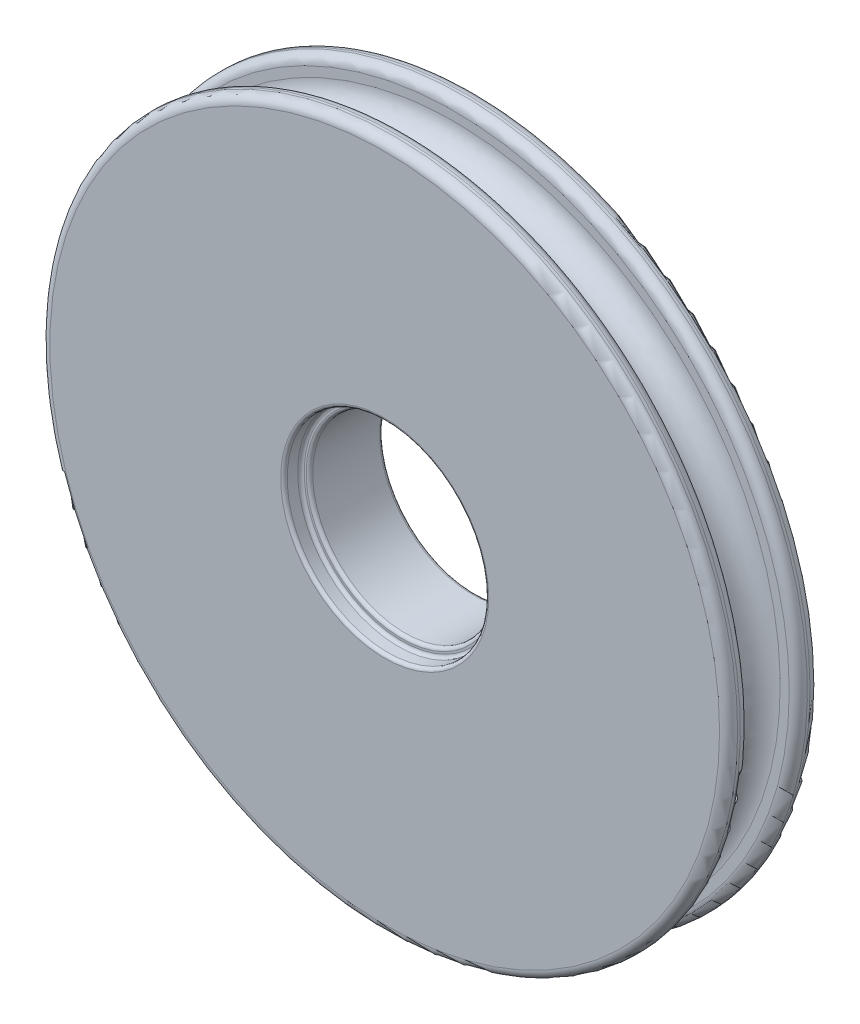
ISO-10303-21;
HEADER;
FILE_DESCRIPTION(('STEP AP214'),'2;1');
FILE_NAME('part.step','',(''),(''),'','','');
FILE_SCHEMA(('AUTOMOTIVE_DESIGN { 1 0 10303 214 1 1 1 1 }'));
ENDSEC;
DATA;
#1=APPLICATION_CONTEXT('core data for automotive mechanical design processes');
#2=APPLICATION_PROTOCOL_DEFINITION('international standard','automotive_design',2000,#1);
#3=PRODUCT_CONTEXT('',#1,'mechanical');
#4=PRODUCT('Part','Part','',(#3));
#5=PRODUCT_RELATED_PRODUCT_CATEGORY('part','',(#4));
#6=PRODUCT_DEFINITION_FORMATION('','',#4);
#7=PRODUCT_DEFINITION_CONTEXT('part definition',#1,'design');
#8=PRODUCT_DEFINITION('design','',#6,#7);
#9=PRODUCT_DEFINITION_SHAPE('','',#8);
#10=(LENGTH_UNIT() NAMED_UNIT(*) SI_UNIT(.MILLI.,.METRE.));
#11=(NAMED_UNIT(*) PLANE_ANGLE_UNIT() SI_UNIT($,.RADIAN.));
#12=(NAMED_UNIT(*) SI_UNIT($,.STERADIAN.) SOLID_ANGLE_UNIT());
#13=UNCERTAINTY_MEASURE_WITH_UNIT(LENGTH_MEASURE(1.E-05),#10,'distance_accuracy_value','');
#14=(GEOMETRIC_REPRESENTATION_CONTEXT(3) GLOBAL_UNCERTAINTY_ASSIGNED_CONTEXT((#13)) GLOBAL_UNIT_ASSIGNED_CONTEXT((#10,
#11,#12)) REPRESENTATION_CONTEXT('',''));
#15=CARTESIAN_POINT('',(0.,0.,0.));
#16=DIRECTION('',(0.,0.,1.));
#17=DIRECTION('',(1.,0.,0.));
#18=AXIS2_PLACEMENT_3D('',#15,#16,#17);
#19=CARTESIAN_POINT('',(0.,0.,-3.175));
#20=DIRECTION('',(0.,0.,1.));
#21=DIRECTION('',(1.,0.,0.));
#22=AXIS2_PLACEMENT_3D('',#19,#20,#21);
#23=CYLINDRICAL_SURFACE('',#22,6.477);
#24=CARTESIAN_POINT('',(0.,0.,-2.9464));
#25=DIRECTION('',(0.,0.,1.));
#26=DIRECTION('',(1.,0.,0.));
#27=AXIS2_PLACEMENT_3D('',#24,#25,#26);
#28=CIRCLE('',#27,6.477);
#29=CARTESIAN_POINT('',(6.477,0.,-2.9464));
#30=VERTEX_POINT('',#29);
#31=EDGE_CURVE('E95',#30,#30,#28,.F.);
#32=ORIENTED_EDGE('',*,*,#31,.T.);
#33=EDGE_LOOP('',(#32));
#34=FACE_BOUND('',#33,.T.);
#35=CARTESIAN_POINT('',(0.,0.,1.755775));
#36=DIRECTION('',(0.,0.,1.));
#37=DIRECTION('',(1.,0.,0.));
#38=AXIS2_PLACEMENT_3D('',#35,#36,#37);
#39=CIRCLE('',#38,6.477);
#40=CARTESIAN_POINT('',(6.477,0.,1.755775));
#41=VERTEX_POINT('',#40);
#42=EDGE_CURVE('E92',#41,#41,#39,.T.);
#43=ORIENTED_EDGE('',*,*,#42,.T.);
#44=EDGE_LOOP('',(#43));
#45=FACE_BOUND('',#44,.T.);
#46=ADVANCED_FACE('F37',(#34,#45),#23,.F.);
#47=CARTESIAN_POINT('',(0.,0.,3.175));
#48=DIRECTION('',(0.,0.,-1.));
#49=DIRECTION('',(-1.,0.,0.));
#50=AXIS2_PLACEMENT_3D('',#47,#48,#49);
#51=CYLINDRICAL_SURFACE('',#50,24.13);
#52=CARTESIAN_POINT('',(0.,0.,-2.54));
#53=DIRECTION('',(0.,0.,1.));
#54=DIRECTION('',(1.,0.,0.));
#55=AXIS2_PLACEMENT_3D('',#52,#53,#54);
#56=CIRCLE('',#55,24.13);
#57=CARTESIAN_POINT('',(24.13,0.,-2.54));
#58=VERTEX_POINT('',#57);
#59=EDGE_CURVE('E116',#58,#58,#56,.T.);
#60=ORIENTED_EDGE('',*,*,#59,.T.);
#61=EDGE_LOOP('',(#60));
#62=FACE_BOUND('',#61,.T.);
#63=CARTESIAN_POINT('',(0.,0.,-2.3495));
#64=DIRECTION('',(0.,0.,-1.));
#65=DIRECTION('',(-1.,0.,0.));
#66=AXIS2_PLACEMENT_3D('',#63,#64,#65);
#67=CIRCLE('',#66,24.13);
#68=CARTESIAN_POINT('',(-4.77145825789316,-23.6535427810124,-2.3495));
#69=VERTEX_POINT('',#68);
#70=EDGE_CURVE('E113',#69,#69,#67,.T.);
#71=ORIENTED_EDGE('',*,*,#70,.T.);
#72=EDGE_LOOP('',(#71));
#73=FACE_BOUND('',#72,.T.);
#74=ADVANCED_FACE('F147',(#62,#73),#51,.T.);
#75=CARTESIAN_POINT('',(0.,0.,-3.175));
#76=DIRECTION('',(0.,0.,1.));
#77=DIRECTION('',(1.,0.,0.));
#78=AXIS2_PLACEMENT_3D('',#75,#76,#77);
#79=PLANE('',#78);
#80=CARTESIAN_POINT('',(0.,0.,-3.175));
#81=DIRECTION('',(0.,0.,1.));
#82=DIRECTION('',(1.,0.,0.));
#83=AXIS2_PLACEMENT_3D('',#80,#81,#82);
#84=CIRCLE('',#83,23.495);
#85=CARTESIAN_POINT('',(23.495,0.,-3.175));
#86=VERTEX_POINT('',#85);
#87=EDGE_CURVE('E119',#86,#86,#84,.F.);
#88=ORIENTED_EDGE('',*,*,#87,.T.);
#89=EDGE_LOOP('',(#88));
#90=FACE_BOUND('',#89,.T.);
#91=CARTESIAN_POINT('',(0.,0.,-3.175));
#92=DIRECTION('',(0.,0.,1.));
#93=DIRECTION('',(1.,0.,0.));
#94=AXIS2_PLACEMENT_3D('',#91,#92,#93);
#95=CIRCLE('',#94,6.7056);
#96=CARTESIAN_POINT('',(6.7056,0.,-3.175));
#97=VERTEX_POINT('',#96);
#98=EDGE_CURVE('E84',#97,#97,#95,.T.);
#99=ORIENTED_EDGE('',*,*,#98,.T.);
#100=EDGE_LOOP('',(#99));
#101=FACE_BOUND('',#100,.T.);
#102=ADVANCED_FACE('F140',(#90,#101),#79,.F.);
#103=CARTESIAN_POINT('',(-4.64589356689597,-22.3829236911775,-1.7145));
#104=DIRECTION('',(0.,0.,-1.));
#105=DIRECTION('',(-1.,0.,0.));
#106=AXIS2_PLACEMENT_3D('',#103,#104,#105);
#107=PLANE('',#106);
#108=CARTESIAN_POINT('',(0.,0.,-1.7145));
#109=DIRECTION('',(0.,0.,-1.));
#110=DIRECTION('',(-0.203232439496762,-0.979130520173993,0.));
#111=AXIS2_PLACEMENT_3D('',#108,#109,#110);
#112=CIRCLE('',#111,22.86);
#113=CARTESIAN_POINT('',(-4.64589356689597,-22.3829236911775,-1.7145));
#114=VERTEX_POINT('',#113);
#115=EDGE_CURVE('E81',#114,#114,#112,.T.);
#116=ORIENTED_EDGE('',*,*,#115,.T.);
#117=EDGE_LOOP('',(#116));
#118=FACE_BOUND('',#117,.T.);
#119=CARTESIAN_POINT('',(0.,0.,-1.7145));
#120=DIRECTION('',(0.,0.,-1.));
#121=DIRECTION('',(-1.,0.,0.));
#122=AXIS2_PLACEMENT_3D('',#119,#120,#121);
#123=CIRCLE('',#122,23.495);
#124=CARTESIAN_POINT('',(-4.64589356689597,-23.0310811288805,-1.7145));
#125=VERTEX_POINT('',#124);
#126=EDGE_CURVE('E122',#125,#125,#123,.F.);
#127=ORIENTED_EDGE('',*,*,#126,.T.);
#128=EDGE_LOOP('',(#127));
#129=FACE_BOUND('',#128,.T.);
#130=ADVANCED_FACE('F138',(#118,#129),#107,.F.);
#131=CARTESIAN_POINT('',(-4.64589356689597,-25.6945450900008,1.7145));
#132=DIRECTION('',(0.,0.,1.));
#133=DIRECTION('',(1.,0.,0.));
#134=AXIS2_PLACEMENT_3D('',#131,#132,#133);
#135=PLANE('',#134);
#136=CARTESIAN_POINT('',(0.,0.,1.7145));
#137=DIRECTION('',(0.,0.,-1.));
#138=DIRECTION('',(-0.203232439496762,-0.979130520173993,0.));
#139=AXIS2_PLACEMENT_3D('',#136,#137,#138);
#140=CIRCLE('',#139,22.86);
#141=CARTESIAN_POINT('',(-4.64589356689597,-22.3829236911775,1.7145));
#142=VERTEX_POINT('',#141);
#143=EDGE_CURVE('E72',#142,#142,#140,.T.);
#144=ORIENTED_EDGE('',*,*,#143,.F.);
#145=EDGE_LOOP('',(#144));
#146=FACE_BOUND('',#145,.T.);
#147=CARTESIAN_POINT('',(0.,0.,1.7145));
#148=DIRECTION('',(0.,0.,1.));
#149=DIRECTION('',(1.,0.,0.));
#150=AXIS2_PLACEMENT_3D('',#147,#148,#149);
#151=CIRCLE('',#150,23.495);
#152=CARTESIAN_POINT('',(-4.64589356689597,-23.0310811288805,1.7145));
#153=VERTEX_POINT('',#152);
#154=EDGE_CURVE('E11',#153,#153,#151,.F.);
#155=ORIENTED_EDGE('',*,*,#154,.T.);
#156=EDGE_LOOP('',(#155));
#157=FACE_BOUND('',#156,.T.);
#158=ADVANCED_FACE('F71',(#146,#157),#135,.F.);
#159=CARTESIAN_POINT('',(-4.64589356689597,-22.3829236911775,1.7145));
#160=CARTESIAN_POINT('',(-49.4117409492509,-13.0911365573855,1.7145));
#161=CARTESIAN_POINT('',(-40.119953815459,31.6747108249694,1.7145));
#162=CARTESIAN_POINT('',(4.64589356689597,22.3829236911775,1.7145));
#163=CARTESIAN_POINT('',(49.4117409492509,13.0911365573855,1.7145));
#164=CARTESIAN_POINT('',(40.119953815459,-31.6747108249694,1.7145));
#165=CARTESIAN_POINT('',(-4.64589356689597,-22.3829236911775,1.7145));
#166=CARTESIAN_POINT('',(-4.64589356689597,-18.9539236911775,1.7145));
#167=CARTESIAN_POINT('',(-42.553740949251,-9.66213655738554,1.7145));
#168=CARTESIAN_POINT('',(-33.261953815459,28.2457108249694,1.7145));
#169=CARTESIAN_POINT('',(4.64589356689597,18.9539236911775,1.7145));
#170=CARTESIAN_POINT('',(42.553740949251,9.66213655738554,1.7145));
#171=CARTESIAN_POINT('',(33.261953815459,-28.2457108249694,1.7145));
#172=CARTESIAN_POINT('',(-4.64589356689597,-18.9539236911775,1.7145));
#173=CARTESIAN_POINT('',(-4.64589356689597,-18.9539236911775,-1.7145));
#174=CARTESIAN_POINT('',(-42.553740949251,-9.66213655738554,-1.7145));
#175=CARTESIAN_POINT('',(-33.261953815459,28.2457108249694,-1.7145));
#176=CARTESIAN_POINT('',(4.64589356689597,18.9539236911775,-1.7145));
#177=CARTESIAN_POINT('',(42.553740949251,9.66213655738554,-1.7145));
#178=CARTESIAN_POINT('',(33.261953815459,-28.2457108249694,-1.7145));
#179=CARTESIAN_POINT('',(-4.64589356689597,-18.9539236911775,-1.7145));
#180=CARTESIAN_POINT('',(-4.64589356689597,-22.3829236911775,-1.7145));
#181=CARTESIAN_POINT('',(-49.4117409492509,-13.0911365573855,-1.7145));
#182=CARTESIAN_POINT('',(-40.119953815459,31.6747108249694,-1.7145));
#183=CARTESIAN_POINT('',(4.64589356689597,22.3829236911775,-1.7145));
#184=CARTESIAN_POINT('',(49.4117409492509,13.0911365573855,-1.7145));
#185=CARTESIAN_POINT('',(40.119953815459,-31.6747108249694,-1.7145));
#186=CARTESIAN_POINT('',(-4.64589356689597,-22.3829236911775,-1.7145));
#187=(BOUNDED_SURFACE() B_SPLINE_SURFACE(3,3,((#159,#160,#161,#162,#163,#164,#165),(#166,#167,
#168,#169,#170,#171,#172),(#173,#174,#175,#176,#177,#178,#179),(#180,#181,#182,#183,#184,#185,
#186)),.UNSPECIFIED.,.F.,.T.,.F.) B_SPLINE_SURFACE_WITH_KNOTS((4,4),(4,3,4),(0.,1.),(0.,0.5,1.),
.UNSPECIFIED.) GEOMETRIC_REPRESENTATION_ITEM() RATIONAL_B_SPLINE_SURFACE(((1.,0.333333333333333,
0.333333333333333,1.,0.333333333333333,0.333333333333333,1.),(0.333333333333333,
0.111111111111111,0.111111111111111,0.333333333333333,0.111111111111111,0.111111111111111,
0.333333333333333),(0.333333333333333,0.111111111111111,0.111111111111111,0.333333333333333,
0.111111111111111,0.111111111111111,0.333333333333333),(1.,0.333333333333333,0.333333333333333,
1.,0.333333333333333,0.333333333333333,1.))) REPRESENTATION_ITEM('') SURFACE());
#188=CARTESIAN_POINT('',(-4.64589356689597,-22.3829236911775,0.));
#189=DIRECTION('',(-1.,0.,0.));
#190=DIRECTION('',(0.,0.,1.));
#191=AXIS2_PLACEMENT_3D('',#188,#189,#190);
#192=CIRCLE('',#191,1.7145);
#193=EDGE_CURVE('E74',#142,#114,#192,.T.);
#194=ORIENTED_EDGE('',*,*,#193,.T.);
#195=ORIENTED_EDGE('',*,*,#115,.F.);
#196=ORIENTED_EDGE('',*,*,#193,.F.);
#197=ORIENTED_EDGE('',*,*,#143,.T.);
#198=EDGE_LOOP('',(#194,#195,#196,#197));
#199=FACE_BOUND('',#198,.T.);
#200=ADVANCED_FACE('F79',(#199),#187,.F.);
#201=CARTESIAN_POINT('',(0.,0.,3.175));
#202=DIRECTION('',(0.,0.,1.));
#203=DIRECTION('',(1.,0.,0.));
#204=AXIS2_PLACEMENT_3D('',#201,#202,#203);
#205=PLANE('',#204);
#206=CARTESIAN_POINT('',(0.,0.,3.175));
#207=DIRECTION('',(0.,0.,1.));
#208=DIRECTION('',(1.,0.,0.));
#209=AXIS2_PLACEMENT_3D('',#206,#207,#208);
#210=CIRCLE('',#209,23.495);
#211=CARTESIAN_POINT('',(23.495,0.,3.175));
#212=VERTEX_POINT('',#211);
#213=EDGE_CURVE('E125',#212,#212,#210,.T.);
#214=ORIENTED_EDGE('',*,*,#213,.T.);
#215=EDGE_LOOP('',(#214));
#216=FACE_BOUND('',#215,.T.);
#217=CARTESIAN_POINT('',(0.,0.,3.175));
#218=DIRECTION('',(0.,0.,1.));
#219=DIRECTION('',(1.,0.,0.));
#220=AXIS2_PLACEMENT_3D('',#217,#218,#219);
#221=CIRCLE('',#220,7.3009125);
#222=CARTESIAN_POINT('',(7.3009125,0.,3.175));
#223=VERTEX_POINT('',#222);
#224=EDGE_CURVE('E110',#223,#223,#221,.F.);
#225=ORIENTED_EDGE('',*,*,#224,.T.);
#226=EDGE_LOOP('',(#225));
#227=FACE_BOUND('',#226,.T.);
#228=ADVANCED_FACE('F168',(#216,#227),#205,.T.);
#229=CARTESIAN_POINT('',(0.,0.,2.54));
#230=DIRECTION('',(0.,0.,1.));
#231=DIRECTION('',(1.,0.,0.));
#232=AXIS2_PLACEMENT_3D('',#229,#230,#231);
#233=CIRCLE('',#232,24.13);
#234=CARTESIAN_POINT('',(24.13,0.,2.54));
#235=VERTEX_POINT('',#234);
#236=EDGE_CURVE('E46',#235,#235,#233,.F.);
#237=ORIENTED_EDGE('',*,*,#236,.T.);
#238=EDGE_LOOP('',(#237));
#239=FACE_BOUND('',#238,.T.);
#240=CARTESIAN_POINT('',(0.,0.,2.3495));
#241=DIRECTION('',(0.,0.,1.));
#242=DIRECTION('',(1.,0.,0.));
#243=AXIS2_PLACEMENT_3D('',#240,#241,#242);
#244=CIRCLE('',#243,24.13);
#245=CARTESIAN_POINT('',(-4.77145825789316,-23.6535427810124,2.3495));
#246=VERTEX_POINT('',#245);
#247=EDGE_CURVE('E128',#246,#246,#244,.T.);
#248=ORIENTED_EDGE('',*,*,#247,.T.);
#249=EDGE_LOOP('',(#248));
#250=FACE_BOUND('',#249,.T.);
#251=ADVANCED_FACE('F160',(#239,#250),#51,.T.);
#252=CARTESIAN_POINT('',(0.,0.,1.984375));
#253=DIRECTION('',(0.,0.,1.));
#254=DIRECTION('',(1.,0.,0.));
#255=AXIS2_PLACEMENT_3D('',#252,#253,#254);
#256=PLANE('',#255);
#257=CARTESIAN_POINT('',(0.,0.,1.984375));
#258=DIRECTION('',(0.,0.,1.));
#259=DIRECTION('',(1.,0.,0.));
#260=AXIS2_PLACEMENT_3D('',#257,#258,#259);
#261=CIRCLE('',#260,6.7056);
#262=CARTESIAN_POINT('',(6.7056,0.,1.984375));
#263=VERTEX_POINT('',#262);
#264=EDGE_CURVE('E101',#263,#263,#261,.F.);
#265=ORIENTED_EDGE('',*,*,#264,.T.);
#266=EDGE_LOOP('',(#265));
#267=FACE_BOUND('',#266,.T.);
#268=CARTESIAN_POINT('',(0.,0.,1.984375));
#269=DIRECTION('',(0.,0.,1.));
#270=DIRECTION('',(1.,0.,0.));
#271=AXIS2_PLACEMENT_3D('',#268,#269,#270);
#272=CIRCLE('',#271,6.8437125);
#273=CARTESIAN_POINT('',(6.8437125,0.,1.984375));
#274=VERTEX_POINT('',#273);
#275=EDGE_CURVE('E98',#274,#274,#272,.T.);
#276=ORIENTED_EDGE('',*,*,#275,.T.);
#277=EDGE_LOOP('',(#276));
#278=FACE_BOUND('',#277,.T.);
#279=ADVANCED_FACE('F181',(#267,#278),#256,.T.);
#280=CARTESIAN_POINT('',(0.,0.,1.984375));
#281=DIRECTION('',(0.,0.,1.));
#282=DIRECTION('',(1.,0.,0.));
#283=AXIS2_PLACEMENT_3D('',#280,#281,#282);
#284=CYLINDRICAL_SURFACE('',#283,7.0723125);
#285=CARTESIAN_POINT('',(0.,0.,2.212975));
#286=DIRECTION('',(0.,0.,1.));
#287=DIRECTION('',(1.,0.,0.));
#288=AXIS2_PLACEMENT_3D('',#285,#286,#287);
#289=CIRCLE('',#288,7.0723125);
#290=CARTESIAN_POINT('',(7.0723125,0.,2.212975));
#291=VERTEX_POINT('',#290);
#292=EDGE_CURVE('E107',#291,#291,#289,.F.);
#293=CARTESIAN_POINT('',(0.,0.,2.9464));
#294=DIRECTION('',(0.,0.,1.));
#295=DIRECTION('',(1.,0.,0.));
#296=AXIS2_PLACEMENT_3D('',#293,#294,#295);
#297=CIRCLE('',#296,7.0723125);
#298=CARTESIAN_POINT('',(7.0723125,0.,2.9464));
#299=VERTEX_POINT('',#298);
#300=EDGE_CURVE('E104',#299,#299,#297,.T.);
#301=CARTESIAN_POINT('',(7.0723125,0.,2.212975));
#302=CARTESIAN_POINT('',(7.0723125,0.,2.22061484375));
#303=CARTESIAN_POINT('',(7.0723125,0.,2.2282546875));
#304=CARTESIAN_POINT('',(7.0723125,0.,2.243534375));
#305=CARTESIAN_POINT('',(7.0723125,0.,2.25117421875));
#306=CARTESIAN_POINT('',(7.0723125,0.,2.26645390625));
#307=CARTESIAN_POINT('',(7.0723125,0.,2.27409375));
#308=CARTESIAN_POINT('',(7.0723125,0.,2.2893734375));
#309=CARTESIAN_POINT('',(7.0723125,0.,2.29701328125));
#310=CARTESIAN_POINT('',(7.0723125,0.,2.31229296875));
#311=CARTESIAN_POINT('',(7.0723125,0.,2.3199328125));
#312=CARTESIAN_POINT('',(7.0723125,0.,2.3352125));
#313=CARTESIAN_POINT('',(7.0723125,0.,2.34285234375));
#314=CARTESIAN_POINT('',(7.0723125,0.,2.35813203125));
#315=CARTESIAN_POINT('',(7.0723125,0.,2.365771875));
#316=CARTESIAN_POINT('',(7.0723125,0.,2.3810515625));
#317=CARTESIAN_POINT('',(7.0723125,0.,2.38869140625));
#318=CARTESIAN_POINT('',(7.0723125,0.,2.40397109375));
#319=CARTESIAN_POINT('',(7.0723125,0.,2.4116109375));
#320=CARTESIAN_POINT('',(7.0723125,0.,2.426890625));
#321=CARTESIAN_POINT('',(7.0723125,0.,2.43453046875));
#322=CARTESIAN_POINT('',(7.0723125,0.,2.44981015625));
#323=CARTESIAN_POINT('',(7.0723125,0.,2.45745));
#324=CARTESIAN_POINT('',(7.0723125,0.,2.4727296875));
#325=CARTESIAN_POINT('',(7.0723125,0.,2.48036953125));
#326=CARTESIAN_POINT('',(7.0723125,0.,2.49564921875));
#327=CARTESIAN_POINT('',(7.0723125,0.,2.5032890625));
#328=CARTESIAN_POINT('',(7.0723125,0.,2.51856875));
#329=CARTESIAN_POINT('',(7.0723125,0.,2.52620859375));
#330=CARTESIAN_POINT('',(7.0723125,0.,2.54148828125));
#331=CARTESIAN_POINT('',(7.0723125,0.,2.549128125));
#332=CARTESIAN_POINT('',(7.0723125,0.,2.5644078125));
#333=CARTESIAN_POINT('',(7.0723125,0.,2.57204765625));
#334=CARTESIAN_POINT('',(7.0723125,0.,2.58732734375));
#335=CARTESIAN_POINT('',(7.0723125,0.,2.5949671875));
#336=CARTESIAN_POINT('',(7.0723125,0.,2.610246875));
#337=CARTESIAN_POINT('',(7.0723125,0.,2.61788671875));
#338=CARTESIAN_POINT('',(7.0723125,0.,2.63316640625));
#339=CARTESIAN_POINT('',(7.0723125,0.,2.64080625));
#340=CARTESIAN_POINT('',(7.0723125,0.,2.6560859375));
#341=CARTESIAN_POINT('',(7.0723125,0.,2.66372578125));
#342=CARTESIAN_POINT('',(7.0723125,0.,2.67900546875));
#343=CARTESIAN_POINT('',(7.0723125,0.,2.6866453125));
#344=CARTESIAN_POINT('',(7.0723125,0.,2.701925));
#345=CARTESIAN_POINT('',(7.0723125,0.,2.70956484375));
#346=CARTESIAN_POINT('',(7.0723125,0.,2.72484453125));
#347=CARTESIAN_POINT('',(7.0723125,0.,2.732484375));
#348=CARTESIAN_POINT('',(7.0723125,0.,2.7477640625));
#349=CARTESIAN_POINT('',(7.0723125,0.,2.75540390625));
#350=CARTESIAN_POINT('',(7.0723125,0.,2.77068359375));
#351=CARTESIAN_POINT('',(7.0723125,0.,2.7783234375));
#352=CARTESIAN_POINT('',(7.0723125,0.,2.793603125));
#353=CARTESIAN_POINT('',(7.0723125,0.,2.80124296875));
#354=CARTESIAN_POINT('',(7.0723125,0.,2.81652265625));
#355=CARTESIAN_POINT('',(7.0723125,0.,2.8241625));
#356=CARTESIAN_POINT('',(7.0723125,0.,2.8394421875));
#357=CARTESIAN_POINT('',(7.0723125,0.,2.84708203125));
#358=CARTESIAN_POINT('',(7.0723125,0.,2.86236171875));
#359=CARTESIAN_POINT('',(7.0723125,0.,2.8700015625));
#360=CARTESIAN_POINT('',(7.0723125,0.,2.88528125));
#361=CARTESIAN_POINT('',(7.0723125,0.,2.89292109375));
#362=CARTESIAN_POINT('',(7.0723125,0.,2.90820078125));
#363=CARTESIAN_POINT('',(7.0723125,0.,2.915840625));
#364=CARTESIAN_POINT('',(7.0723125,0.,2.9311203125));
#365=CARTESIAN_POINT('',(7.0723125,0.,2.93876015625));
#366=CARTESIAN_POINT('',(7.0723125,0.,2.9464));
#367=B_SPLINE_CURVE_WITH_KNOTS('',3,(#301,#302,#303,#304,#305,#306,#307,#308,#309,#310,#311,
#312,#313,#314,#315,#316,#317,#318,#319,#320,#321,#322,#323,#324,#325,#326,#327,#328,#329,#330,
#331,#332,#333,#334,#335,#336,#337,#338,#339,#340,#341,#342,#343,#344,#345,#346,#347,#348,#349,
#350,#351,#352,#353,#354,#355,#356,#357,#358,#359,#360,#361,#362,#363,#364,#365,#366),
.UNSPECIFIED.,.F.,.F.,(4,2,2,2,2,2,2,2,2,2,2,2,2,2,2,2,2,2,2,2,2,2,2,2,2,2,2,2,2,2,2,2,4),(0.,
0.0229195312500003,0.0458390625000002,0.06875859375,0.0916781250000004,0.11459765625,
0.1375171875,0.16043671875,0.18335625,0.20627578125,0.2291953125,0.25211484375,0.275034375,
0.29795390625,0.3208734375,0.34379296875,0.3667125,0.38963203125,0.4125515625,0.43547109375,
0.458390625,0.48131015625,0.5042296875,0.527149218750001,0.55006875,0.57298828125,0.5959078125,
0.61882734375,0.641746875,0.66466640625,0.687585937500001,0.71050546875,0.733425),.UNSPECIFIED.);
#368=EDGE_CURVE('BSEAM163',#291,#299,#367,.T.);
#369=ORIENTED_EDGE('',*,*,#292,.T.);
#370=ORIENTED_EDGE('',*,*,#300,.T.);
#371=ORIENTED_EDGE('',*,*,#368,.T.);
#372=ORIENTED_EDGE('',*,*,#368,.F.);
#373=EDGE_LOOP('',(#369,#371,#370,#372));
#374=FACE_BOUND('',#373,.T.);
#375=ADVANCED_FACE('F163',(#374),#284,.F.);
#376=CARTESIAN_POINT('',(0.,0.,-2.9464));
#377=DIRECTION('',(0.,0.,1.));
#378=DIRECTION('',(1.,0.,0.));
#379=AXIS2_PLACEMENT_3D('',#376,#377,#378);
#380=TOROIDAL_SURFACE('',#379,6.7056,0.2286);
#381=ORIENTED_EDGE('',*,*,#31,.F.);
#382=EDGE_LOOP('',(#381));
#383=FACE_BOUND('',#382,.T.);
#384=ORIENTED_EDGE('',*,*,#98,.F.);
#385=EDGE_LOOP('',(#384));
#386=FACE_BOUND('',#385,.T.);
#387=ADVANCED_FACE('F185',(#383,#386),#380,.T.);
#388=CARTESIAN_POINT('',(0.,0.,1.755775));
#389=DIRECTION('',(0.,0.,1.));
#390=DIRECTION('',(1.,0.,0.));
#391=AXIS2_PLACEMENT_3D('',#388,#389,#390);
#392=TOROIDAL_SURFACE('',#391,6.7056,0.2286);
#393=ORIENTED_EDGE('',*,*,#42,.F.);
#394=EDGE_LOOP('',(#393));
#395=FACE_BOUND('',#394,.T.);
#396=ORIENTED_EDGE('',*,*,#264,.F.);
#397=EDGE_LOOP('',(#396));
#398=FACE_BOUND('',#397,.T.);
#399=ADVANCED_FACE('F188',(#395,#398),#392,.T.);
#400=CARTESIAN_POINT('',(0.,0.,2.212975));
#401=DIRECTION('',(0.,0.,1.));
#402=DIRECTION('',(1.,0.,0.));
#403=AXIS2_PLACEMENT_3D('',#400,#401,#402);
#404=TOROIDAL_SURFACE('',#403,6.8437125,0.2286);
#405=ORIENTED_EDGE('',*,*,#292,.F.);
#406=EDGE_LOOP('',(#405));
#407=FACE_BOUND('',#406,.T.);
#408=ORIENTED_EDGE('',*,*,#275,.F.);
#409=EDGE_LOOP('',(#408));
#410=FACE_BOUND('',#409,.T.);
#411=ADVANCED_FACE('F192',(#407,#410),#404,.F.);
#412=CARTESIAN_POINT('',(0.,0.,2.9464));
#413=DIRECTION('',(0.,0.,1.));
#414=DIRECTION('',(1.,0.,0.));
#415=AXIS2_PLACEMENT_3D('',#412,#413,#414);
#416=TOROIDAL_SURFACE('',#415,7.3009125,0.2286);
#417=ORIENTED_EDGE('',*,*,#224,.F.);
#418=EDGE_LOOP('',(#417));
#419=FACE_BOUND('',#418,.T.);
#420=ORIENTED_EDGE('',*,*,#300,.F.);
#421=EDGE_LOOP('',(#420));
#422=FACE_BOUND('',#421,.T.);
#423=ADVANCED_FACE('F196',(#419,#422),#416,.T.);
#424=CARTESIAN_POINT('',(0.,0.,-2.54));
#425=DIRECTION('',(0.,0.,1.));
#426=DIRECTION('',(1.,0.,0.));
#427=AXIS2_PLACEMENT_3D('',#424,#425,#426);
#428=TOROIDAL_SURFACE('',#427,23.495,0.635);
#429=ORIENTED_EDGE('',*,*,#87,.F.);
#430=EDGE_LOOP('',(#429));
#431=FACE_BOUND('',#430,.T.);
#432=ORIENTED_EDGE('',*,*,#59,.F.);
#433=EDGE_LOOP('',(#432));
#434=FACE_BOUND('',#433,.T.);
#435=ADVANCED_FACE('F200',(#431,#434),#428,.T.);
#436=CARTESIAN_POINT('',(0.,0.,-2.3495));
#437=DIRECTION('',(0.,0.,-1.));
#438=DIRECTION('',(-1.,0.,0.));
#439=AXIS2_PLACEMENT_3D('',#436,#437,#438);
#440=TOROIDAL_SURFACE('',#439,23.495,0.635);
#441=CARTESIAN_POINT('',(-4.64589356689597,-23.0310811288805,-2.3495));
#442=DIRECTION('',(0.980254570286465,-0.197739670861713,0.));
#443=DIRECTION('',(0.197739670861713,0.980254570286465,0.));
#444=AXIS2_PLACEMENT_3D('',#441,#442,#443);
#445=CIRCLE('',#444,0.635);
#446=EDGE_CURVE('E75',#125,#69,#445,.T.);
#447=ORIENTED_EDGE('',*,*,#446,.F.);
#448=ORIENTED_EDGE('',*,*,#126,.F.);
#449=ORIENTED_EDGE('',*,*,#446,.T.);
#450=ORIENTED_EDGE('',*,*,#70,.F.);
#451=EDGE_LOOP('',(#447,#448,#449,#450));
#452=FACE_BOUND('',#451,.T.);
#453=ADVANCED_FACE('F135',(#452),#440,.T.);
#454=CARTESIAN_POINT('',(0.,0.,2.54));
#455=DIRECTION('',(0.,0.,1.));
#456=DIRECTION('',(1.,0.,0.));
#457=AXIS2_PLACEMENT_3D('',#454,#455,#456);
#458=TOROIDAL_SURFACE('',#457,23.495,0.635);
#459=ORIENTED_EDGE('',*,*,#236,.F.);
#460=EDGE_LOOP('',(#459));
#461=FACE_BOUND('',#460,.T.);
#462=ORIENTED_EDGE('',*,*,#213,.F.);
#463=EDGE_LOOP('',(#462));
#464=FACE_BOUND('',#463,.T.);
#465=ADVANCED_FACE('F206',(#461,#464),#458,.T.);
#466=CARTESIAN_POINT('',(0.,0.,2.3495));
#467=DIRECTION('',(0.,0.,1.));
#468=DIRECTION('',(1.,0.,0.));
#469=AXIS2_PLACEMENT_3D('',#466,#467,#468);
#470=TOROIDAL_SURFACE('',#469,23.495,0.635);
#471=CARTESIAN_POINT('',(-4.64589356689597,-23.0310811288805,2.3495));
#472=DIRECTION('',(-0.980254570286465,0.197739670861714,0.));
#473=DIRECTION('',(-0.197739670861714,-0.980254570286465,0.));
#474=AXIS2_PLACEMENT_3D('',#471,#472,#473);
#475=CIRCLE('',#474,0.635);
#476=EDGE_CURVE('E41',#153,#246,#475,.T.);
#477=ORIENTED_EDGE('',*,*,#476,.F.);
#478=ORIENTED_EDGE('',*,*,#154,.F.);
#479=ORIENTED_EDGE('',*,*,#476,.T.);
#480=ORIENTED_EDGE('',*,*,#247,.F.);
#481=EDGE_LOOP('',(#477,#478,#479,#480));
#482=FACE_BOUND('',#481,.T.);
#483=ADVANCED_FACE('F39',(#482),#470,.T.);
#484=CLOSED_SHELL('',(#46,#74,#102,#130,#158,#200,#228,#251,#279,#375,#387,#399,#411,#423,#435,
#453,#465,#483));
#485=MANIFOLD_SOLID_BREP('B2',#484);
#486=ADVANCED_BREP_SHAPE_REPRESENTATION('',(#18,#485),#14);
#487=SHAPE_DEFINITION_REPRESENTATION(#9,#486);
ENDSEC;
END-ISO-10303-21;
